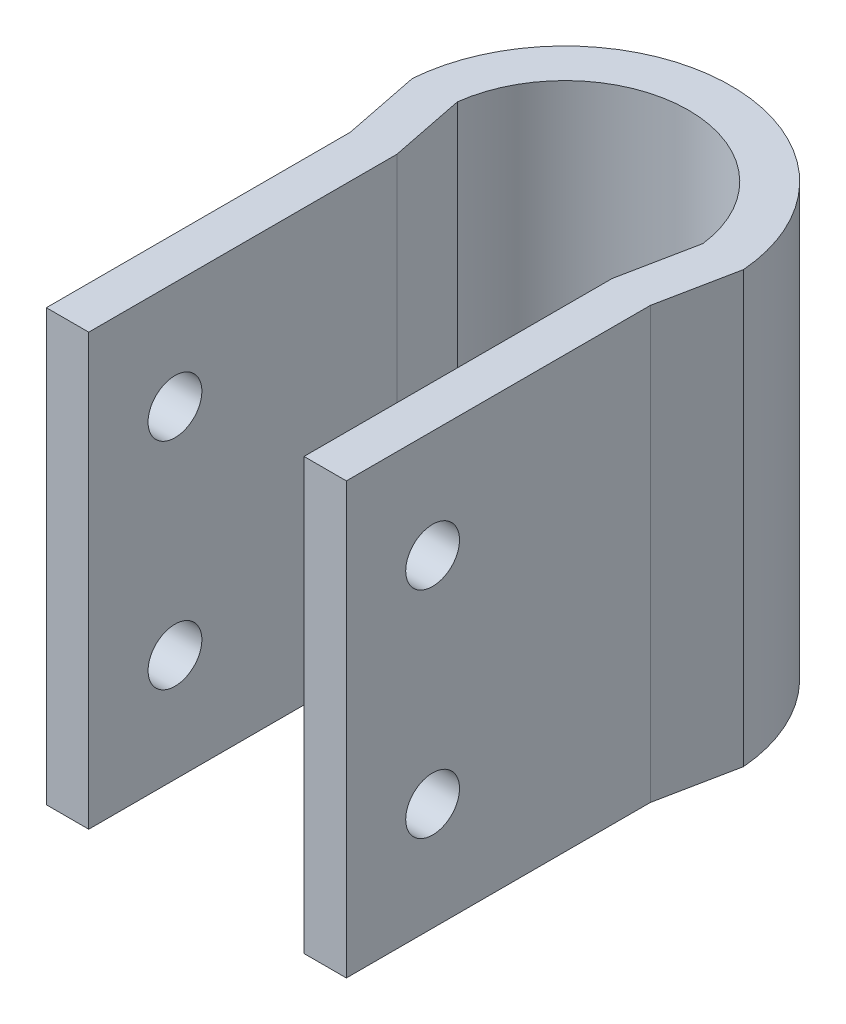
ISO-10303-21;
HEADER;
FILE_DESCRIPTION(('STEP AP214'),'2;1');
FILE_NAME('part.step','',(''),(''),'','','');
FILE_SCHEMA(('AUTOMOTIVE_DESIGN { 1 0 10303 214 1 1 1 1 }'));
ENDSEC;
DATA;
#1=APPLICATION_CONTEXT('core data for automotive mechanical design processes');
#2=APPLICATION_PROTOCOL_DEFINITION('international standard','automotive_design',2000,#1);
#3=PRODUCT_CONTEXT('',#1,'mechanical');
#4=PRODUCT('Part','Part','',(#3));
#5=PRODUCT_RELATED_PRODUCT_CATEGORY('part','',(#4));
#6=PRODUCT_DEFINITION_FORMATION('','',#4);
#7=PRODUCT_DEFINITION_CONTEXT('part definition',#1,'design');
#8=PRODUCT_DEFINITION('design','',#6,#7);
#9=PRODUCT_DEFINITION_SHAPE('','',#8);
#10=(LENGTH_UNIT() NAMED_UNIT(*) SI_UNIT(.MILLI.,.METRE.));
#11=(NAMED_UNIT(*) PLANE_ANGLE_UNIT() SI_UNIT($,.RADIAN.));
#12=(NAMED_UNIT(*) SI_UNIT($,.STERADIAN.) SOLID_ANGLE_UNIT());
#13=UNCERTAINTY_MEASURE_WITH_UNIT(LENGTH_MEASURE(1.E-05),#10,'distance_accuracy_value','');
#14=(GEOMETRIC_REPRESENTATION_CONTEXT(3) GLOBAL_UNCERTAINTY_ASSIGNED_CONTEXT((#13)) GLOBAL_UNIT_ASSIGNED_CONTEXT((#10,
#11,#12)) REPRESENTATION_CONTEXT('',''));
#15=CARTESIAN_POINT('',(0.,0.,0.));
#16=DIRECTION('',(0.,0.,1.));
#17=DIRECTION('',(1.,0.,0.));
#18=AXIS2_PLACEMENT_3D('',#15,#16,#17);
#19=CARTESIAN_POINT('',(-17.7,318.77,43.48));
#20=DIRECTION('',(0.,0.,1.));
#21=DIRECTION('',(1.,0.,0.));
#22=AXIS2_PLACEMENT_3D('',#19,#20,#21);
#23=PLANE('',#22);
#24=DIRECTION('',(1.,0.,0.));
#25=VECTOR('',#24,1.);
#26=CARTESIAN_POINT('',(-17.7,369.57,43.48));
#27=LINE('',#26,#25);
#28=CARTESIAN_POINT('',(-17.7,369.57,43.48));
#29=VERTEX_POINT('',#28);
#30=CARTESIAN_POINT('',(-12.7,369.57,43.48));
#31=VERTEX_POINT('',#30);
#32=EDGE_CURVE('E173',#29,#31,#27,.T.);
#33=ORIENTED_EDGE('',*,*,#32,.F.);
#34=DIRECTION('',(0.,1.,0.));
#35=VECTOR('',#34,1.);
#36=CARTESIAN_POINT('',(-17.7,318.77,43.48));
#37=LINE('',#36,#35);
#38=CARTESIAN_POINT('',(-17.7,318.77,43.48));
#39=VERTEX_POINT('',#38);
#40=EDGE_CURVE('E11',#39,#29,#37,.T.);
#41=ORIENTED_EDGE('',*,*,#40,.F.);
#42=DIRECTION('',(1.,0.,0.));
#43=VECTOR('',#42,1.);
#44=CARTESIAN_POINT('',(-17.7,318.77,43.48));
#45=LINE('',#44,#43);
#46=CARTESIAN_POINT('',(-12.7,318.77,43.48));
#47=VERTEX_POINT('',#46);
#48=EDGE_CURVE('E218',#39,#47,#45,.T.);
#49=ORIENTED_EDGE('',*,*,#48,.T.);
#50=DIRECTION('',(0.,1.,0.));
#51=VECTOR('',#50,1.);
#52=CARTESIAN_POINT('',(-12.7,318.77,43.48));
#53=LINE('',#52,#51);
#54=EDGE_CURVE('E114',#47,#31,#53,.T.);
#55=ORIENTED_EDGE('',*,*,#54,.T.);
#56=EDGE_LOOP('',(#33,#41,#49,#55));
#57=FACE_BOUND('',#56,.T.);
#58=ADVANCED_FACE('F45',(#57),#23,.T.);
#59=CARTESIAN_POINT('',(-17.7,318.77,43.48));
#60=DIRECTION('',(-1.,0.,0.));
#61=DIRECTION('',(0.,0.,1.));
#62=AXIS2_PLACEMENT_3D('',#59,#60,#61);
#63=PLANE('',#62);
#64=CARTESIAN_POINT('',(-17.7,356.87,33.305));
#65=DIRECTION('',(-1.,0.,0.));
#66=DIRECTION('',(0.,0.,1.));
#67=AXIS2_PLACEMENT_3D('',#64,#65,#66);
#68=CIRCLE('',#67,3.175);
#69=CARTESIAN_POINT('',(-17.7,356.87,36.48));
#70=VERTEX_POINT('',#69);
#71=EDGE_CURVE('E250',#70,#70,#68,.T.);
#72=ORIENTED_EDGE('',*,*,#71,.F.);
#73=EDGE_LOOP('',(#72));
#74=FACE_BOUND('',#73,.T.);
#75=CARTESIAN_POINT('',(-17.7,331.47,33.305));
#76=DIRECTION('',(-1.,0.,0.));
#77=DIRECTION('',(0.,0.,-1.));
#78=AXIS2_PLACEMENT_3D('',#75,#76,#77);
#79=CIRCLE('',#78,3.175);
#80=CARTESIAN_POINT('',(-17.7,331.47,30.13));
#81=VERTEX_POINT('',#80);
#82=EDGE_CURVE('E259',#81,#81,#79,.T.);
#83=ORIENTED_EDGE('',*,*,#82,.F.);
#84=EDGE_LOOP('',(#83));
#85=FACE_BOUND('',#84,.T.);
#86=DIRECTION('',(0.,0.,1.));
#87=VECTOR('',#86,1.);
#88=CARTESIAN_POINT('',(-17.7,369.57,43.48));
#89=LINE('',#88,#87);
#90=CARTESIAN_POINT('',(-17.7,369.57,7.61319175216006));
#91=VERTEX_POINT('',#90);
#92=EDGE_CURVE('E215',#91,#29,#89,.T.);
#93=ORIENTED_EDGE('',*,*,#92,.F.);
#94=DIRECTION('',(0.,1.,0.));
#95=VECTOR('',#94,1.);
#96=CARTESIAN_POINT('',(-17.7,318.77,7.61319175216006));
#97=LINE('',#96,#95);
#98=CARTESIAN_POINT('',(-17.7,318.77,7.61319175216006));
#99=VERTEX_POINT('',#98);
#100=EDGE_CURVE('E55',#99,#91,#97,.T.);
#101=ORIENTED_EDGE('',*,*,#100,.F.);
#102=DIRECTION('',(0.,0.,1.));
#103=VECTOR('',#102,1.);
#104=CARTESIAN_POINT('',(-17.7,318.77,43.48));
#105=LINE('',#104,#103);
#106=EDGE_CURVE('E159',#99,#39,#105,.T.);
#107=ORIENTED_EDGE('',*,*,#106,.T.);
#108=ORIENTED_EDGE('',*,*,#40,.T.);
#109=EDGE_LOOP('',(#93,#101,#107,#108));
#110=FACE_BOUND('',#109,.T.);
#111=ADVANCED_FACE('F331',(#74,#85,#110),#63,.T.);
#112=CARTESIAN_POINT('',(-17.7,318.77,7.61319175216006));
#113=DIRECTION('',(-0.980545317992595,0.,0.1962928408343));
#114=DIRECTION('',(0.1962928408343,0.,0.980545317992595));
#115=AXIS2_PLACEMENT_3D('',#112,#113,#114);
#116=PLANE('',#115);
#117=DIRECTION('',(0.1962928408343,0.,0.980545317992595));
#118=VECTOR('',#117,1.);
#119=CARTESIAN_POINT('',(-17.7,369.57,7.61319175216006));
#120=LINE('',#119,#118);
#121=CARTESIAN_POINT('',(-19.5338143213269,369.57,-1.54729540163647));
#122=VERTEX_POINT('',#121);
#123=EDGE_CURVE('E145',#122,#91,#120,.T.);
#124=ORIENTED_EDGE('',*,*,#123,.F.);
#125=DIRECTION('',(0.,1.,0.));
#126=VECTOR('',#125,1.);
#127=CARTESIAN_POINT('',(-19.5338143213269,318.77,-1.54729540163647));
#128=LINE('',#127,#126);
#129=CARTESIAN_POINT('',(-19.5338143213269,318.77,-1.54729540163647));
#130=VERTEX_POINT('',#129);
#131=EDGE_CURVE('E140',#130,#122,#128,.T.);
#132=ORIENTED_EDGE('',*,*,#131,.F.);
#133=DIRECTION('',(0.1962928408343,0.,0.980545317992595));
#134=VECTOR('',#133,1.);
#135=CARTESIAN_POINT('',(-17.7,318.77,7.61319175216006));
#136=LINE('',#135,#134);
#137=EDGE_CURVE('E143',#130,#99,#136,.T.);
#138=ORIENTED_EDGE('',*,*,#137,.T.);
#139=ORIENTED_EDGE('',*,*,#100,.T.);
#140=EDGE_LOOP('',(#124,#132,#138,#139));
#141=FACE_BOUND('',#140,.T.);
#142=ADVANCED_FACE('F142',(#141),#116,.T.);
#143=CARTESIAN_POINT('',(0.,318.77,0.));
#144=DIRECTION('',(0.,1.,0.));
#145=DIRECTION('',(0.,0.,1.));
#146=AXIS2_PLACEMENT_3D('',#143,#144,#145);
#147=CYLINDRICAL_SURFACE('',#146,19.595);
#148=CARTESIAN_POINT('',(0.,369.57,0.));
#149=DIRECTION('',(0.,1.,0.));
#150=DIRECTION('',(0.,0.,-1.));
#151=AXIS2_PLACEMENT_3D('',#148,#149,#150);
#152=CIRCLE('',#151,19.595);
#153=CARTESIAN_POINT('',(19.5338143213269,369.57,-1.54729540163646));
#154=VERTEX_POINT('',#153);
#155=EDGE_CURVE('E210',#154,#122,#152,.T.);
#156=ORIENTED_EDGE('',*,*,#155,.F.);
#157=DIRECTION('',(0.,1.,0.));
#158=VECTOR('',#157,1.);
#159=CARTESIAN_POINT('',(19.5338143213269,318.77,-1.54729540163646));
#160=LINE('',#159,#158);
#161=CARTESIAN_POINT('',(19.5338143213269,318.77,-1.54729540163646));
#162=VERTEX_POINT('',#161);
#163=EDGE_CURVE('E151',#162,#154,#160,.T.);
#164=ORIENTED_EDGE('',*,*,#163,.F.);
#165=CARTESIAN_POINT('',(0.,318.77,0.));
#166=DIRECTION('',(0.,1.,0.));
#167=DIRECTION('',(0.,0.,-1.));
#168=AXIS2_PLACEMENT_3D('',#165,#166,#167);
#169=CIRCLE('',#168,19.595);
#170=EDGE_CURVE('E157',#162,#130,#169,.T.);
#171=ORIENTED_EDGE('',*,*,#170,.T.);
#172=ORIENTED_EDGE('',*,*,#131,.T.);
#173=EDGE_LOOP('',(#156,#164,#171,#172));
#174=FACE_BOUND('',#173,.T.);
#175=ADVANCED_FACE('F162',(#174),#147,.T.);
#176=CARTESIAN_POINT('',(19.5338143213269,318.77,-1.54729540163646));
#177=DIRECTION('',(0.980545317992595,0.,0.1962928408343));
#178=DIRECTION('',(0.1962928408343,0.,-0.980545317992595));
#179=AXIS2_PLACEMENT_3D('',#176,#177,#178);
#180=PLANE('',#179);
#181=DIRECTION('',(0.1962928408343,0.,-0.980545317992596));
#182=VECTOR('',#181,1.);
#183=CARTESIAN_POINT('',(19.5338143213269,369.57,-1.54729540163646));
#184=LINE('',#183,#182);
#185=CARTESIAN_POINT('',(17.7,369.57,7.61319175216007));
#186=VERTEX_POINT('',#185);
#187=EDGE_CURVE('E206',#186,#154,#184,.T.);
#188=ORIENTED_EDGE('',*,*,#187,.F.);
#189=DIRECTION('',(0.,1.,0.));
#190=VECTOR('',#189,1.);
#191=CARTESIAN_POINT('',(17.7,318.77,7.61319175216007));
#192=LINE('',#191,#190);
#193=CARTESIAN_POINT('',(17.7,318.77,7.61319175216007));
#194=VERTEX_POINT('',#193);
#195=EDGE_CURVE('E224',#194,#186,#192,.T.);
#196=ORIENTED_EDGE('',*,*,#195,.F.);
#197=DIRECTION('',(0.1962928408343,0.,-0.980545317992596));
#198=VECTOR('',#197,1.);
#199=CARTESIAN_POINT('',(19.5338143213269,318.77,-1.54729540163646));
#200=LINE('',#199,#198);
#201=EDGE_CURVE('E164',#194,#162,#200,.T.);
#202=ORIENTED_EDGE('',*,*,#201,.T.);
#203=ORIENTED_EDGE('',*,*,#163,.T.);
#204=EDGE_LOOP('',(#188,#196,#202,#203));
#205=FACE_BOUND('',#204,.T.);
#206=ADVANCED_FACE('F347',(#205),#180,.T.);
#207=CARTESIAN_POINT('',(17.7,318.77,7.61319175216007));
#208=DIRECTION('',(1.,0.,0.));
#209=DIRECTION('',(0.,0.,-1.));
#210=AXIS2_PLACEMENT_3D('',#207,#208,#209);
#211=PLANE('',#210);
#212=CARTESIAN_POINT('',(17.7,356.87,33.305));
#213=DIRECTION('',(1.,0.,0.));
#214=DIRECTION('',(0.,0.,-1.));
#215=AXIS2_PLACEMENT_3D('',#212,#213,#214);
#216=CIRCLE('',#215,3.175);
#217=CARTESIAN_POINT('',(17.7,356.87,30.13));
#218=VERTEX_POINT('',#217);
#219=EDGE_CURVE('E178',#218,#218,#216,.T.);
#220=ORIENTED_EDGE('',*,*,#219,.F.);
#221=EDGE_LOOP('',(#220));
#222=FACE_BOUND('',#221,.T.);
#223=CARTESIAN_POINT('',(17.7,331.47,33.305));
#224=DIRECTION('',(1.,0.,0.));
#225=DIRECTION('',(0.,0.,-1.));
#226=AXIS2_PLACEMENT_3D('',#223,#224,#225);
#227=CIRCLE('',#226,3.175);
#228=CARTESIAN_POINT('',(17.7,331.47,30.13));
#229=VERTEX_POINT('',#228);
#230=EDGE_CURVE('E256',#229,#229,#227,.T.);
#231=ORIENTED_EDGE('',*,*,#230,.F.);
#232=EDGE_LOOP('',(#231));
#233=FACE_BOUND('',#232,.T.);
#234=DIRECTION('',(0.,0.,-1.));
#235=VECTOR('',#234,1.);
#236=CARTESIAN_POINT('',(17.7,369.57,7.61319175216007));
#237=LINE('',#236,#235);
#238=CARTESIAN_POINT('',(17.7,369.57,43.48));
#239=VERTEX_POINT('',#238);
#240=EDGE_CURVE('E202',#239,#186,#237,.T.);
#241=ORIENTED_EDGE('',*,*,#240,.F.);
#242=DIRECTION('',(0.,1.,0.));
#243=VECTOR('',#242,1.);
#244=CARTESIAN_POINT('',(17.7,318.77,43.48));
#245=LINE('',#244,#243);
#246=CARTESIAN_POINT('',(17.7,318.77,43.48));
#247=VERTEX_POINT('',#246);
#248=EDGE_CURVE('E227',#247,#239,#245,.T.);
#249=ORIENTED_EDGE('',*,*,#248,.F.);
#250=DIRECTION('',(0.,0.,-1.));
#251=VECTOR('',#250,1.);
#252=CARTESIAN_POINT('',(17.7,318.77,7.61319175216007));
#253=LINE('',#252,#251);
#254=EDGE_CURVE('E167',#247,#194,#253,.T.);
#255=ORIENTED_EDGE('',*,*,#254,.T.);
#256=ORIENTED_EDGE('',*,*,#195,.T.);
#257=EDGE_LOOP('',(#241,#249,#255,#256));
#258=FACE_BOUND('',#257,.T.);
#259=ADVANCED_FACE('F306',(#222,#233,#258),#211,.T.);
#260=CARTESIAN_POINT('',(12.7,318.77,43.48));
#261=DIRECTION('',(0.,0.,1.));
#262=DIRECTION('',(1.,0.,0.));
#263=AXIS2_PLACEMENT_3D('',#260,#261,#262);
#264=PLANE('',#263);
#265=DIRECTION('',(1.,0.,0.));
#266=VECTOR('',#265,1.);
#267=CARTESIAN_POINT('',(12.7,369.57,43.48));
#268=LINE('',#267,#266);
#269=CARTESIAN_POINT('',(12.7,369.57,43.48));
#270=VERTEX_POINT('',#269);
#271=EDGE_CURVE('E198',#270,#239,#268,.T.);
#272=ORIENTED_EDGE('',*,*,#271,.F.);
#273=DIRECTION('',(0.,1.,0.));
#274=VECTOR('',#273,1.);
#275=CARTESIAN_POINT('',(12.7,318.77,43.48));
#276=LINE('',#275,#274);
#277=CARTESIAN_POINT('',(12.7,318.77,43.48));
#278=VERTEX_POINT('',#277);
#279=EDGE_CURVE('E230',#278,#270,#276,.T.);
#280=ORIENTED_EDGE('',*,*,#279,.F.);
#281=DIRECTION('',(1.,0.,0.));
#282=VECTOR('',#281,1.);
#283=CARTESIAN_POINT('',(12.7,318.77,43.48));
#284=LINE('',#283,#282);
#285=EDGE_CURVE('E298',#278,#247,#284,.T.);
#286=ORIENTED_EDGE('',*,*,#285,.T.);
#287=ORIENTED_EDGE('',*,*,#248,.T.);
#288=EDGE_LOOP('',(#272,#280,#286,#287));
#289=FACE_BOUND('',#288,.T.);
#290=ADVANCED_FACE('F312',(#289),#264,.T.);
#291=CARTESIAN_POINT('',(12.7,318.77,7.11763924182101));
#292=DIRECTION('',(-1.,0.,0.));
#293=DIRECTION('',(0.,0.,1.));
#294=AXIS2_PLACEMENT_3D('',#291,#292,#293);
#295=PLANE('',#294);
#296=CARTESIAN_POINT('',(12.7,356.87,33.305));
#297=DIRECTION('',(-1.,0.,0.));
#298=DIRECTION('',(0.,0.,1.));
#299=AXIS2_PLACEMENT_3D('',#296,#297,#298);
#300=CIRCLE('',#299,3.175);
#301=CARTESIAN_POINT('',(12.7,356.87,36.48));
#302=VERTEX_POINT('',#301);
#303=EDGE_CURVE('E270',#302,#302,#300,.T.);
#304=ORIENTED_EDGE('',*,*,#303,.F.);
#305=EDGE_LOOP('',(#304));
#306=FACE_BOUND('',#305,.T.);
#307=CARTESIAN_POINT('',(12.7,331.47,33.305));
#308=DIRECTION('',(-1.,0.,0.));
#309=DIRECTION('',(0.,0.,1.));
#310=AXIS2_PLACEMENT_3D('',#307,#308,#309);
#311=CIRCLE('',#310,3.175);
#312=CARTESIAN_POINT('',(12.7,331.47,36.48));
#313=VERTEX_POINT('',#312);
#314=EDGE_CURVE('E249',#313,#313,#311,.T.);
#315=ORIENTED_EDGE('',*,*,#314,.F.);
#316=EDGE_LOOP('',(#315));
#317=FACE_BOUND('',#316,.T.);
#318=DIRECTION('',(0.,0.,1.));
#319=VECTOR('',#318,1.);
#320=CARTESIAN_POINT('',(12.7,369.57,7.11763924182101));
#321=LINE('',#320,#319);
#322=CARTESIAN_POINT('',(12.7,369.57,7.11763924182101));
#323=VERTEX_POINT('',#322);
#324=EDGE_CURVE('E194',#323,#270,#321,.T.);
#325=ORIENTED_EDGE('',*,*,#324,.F.);
#326=DIRECTION('',(0.,1.,0.));
#327=VECTOR('',#326,1.);
#328=CARTESIAN_POINT('',(12.7,318.77,7.11763924182101));
#329=LINE('',#328,#327);
#330=CARTESIAN_POINT('',(12.7,318.77,7.11763924182101));
#331=VERTEX_POINT('',#330);
#332=EDGE_CURVE('E233',#331,#323,#329,.T.);
#333=ORIENTED_EDGE('',*,*,#332,.F.);
#334=DIRECTION('',(0.,0.,1.));
#335=VECTOR('',#334,1.);
#336=CARTESIAN_POINT('',(12.7,318.77,7.11763924182101));
#337=LINE('',#336,#335);
#338=EDGE_CURVE('E294',#331,#278,#337,.T.);
#339=ORIENTED_EDGE('',*,*,#338,.T.);
#340=ORIENTED_EDGE('',*,*,#279,.T.);
#341=EDGE_LOOP('',(#325,#333,#339,#340));
#342=FACE_BOUND('',#341,.T.);
#343=ADVANCED_FACE('F315',(#306,#317,#342),#295,.T.);
#344=CARTESIAN_POINT('',(14.4841982864085,318.77,-1.795));
#345=DIRECTION('',(-0.980545317992595,0.,-0.1962928408343));
#346=DIRECTION('',(-0.1962928408343,0.,0.980545317992596));
#347=AXIS2_PLACEMENT_3D('',#344,#345,#346);
#348=PLANE('',#347);
#349=DIRECTION('',(-0.1962928408343,0.,0.980545317992595));
#350=VECTOR('',#349,1.);
#351=CARTESIAN_POINT('',(14.4841982864085,369.57,-1.795));
#352=LINE('',#351,#350);
#353=CARTESIAN_POINT('',(14.4841982864085,369.57,-1.795));
#354=VERTEX_POINT('',#353);
#355=EDGE_CURVE('E190',#354,#323,#352,.T.);
#356=ORIENTED_EDGE('',*,*,#355,.F.);
#357=DIRECTION('',(0.,1.,0.));
#358=VECTOR('',#357,1.);
#359=CARTESIAN_POINT('',(14.4841982864085,318.77,-1.795));
#360=LINE('',#359,#358);
#361=CARTESIAN_POINT('',(14.4841982864085,318.77,-1.795));
#362=VERTEX_POINT('',#361);
#363=EDGE_CURVE('E236',#362,#354,#360,.T.);
#364=ORIENTED_EDGE('',*,*,#363,.F.);
#365=DIRECTION('',(-0.1962928408343,0.,0.980545317992595));
#366=VECTOR('',#365,1.);
#367=CARTESIAN_POINT('',(14.4841982864085,318.77,-1.795));
#368=LINE('',#367,#366);
#369=EDGE_CURVE('E290',#362,#331,#368,.T.);
#370=ORIENTED_EDGE('',*,*,#369,.T.);
#371=ORIENTED_EDGE('',*,*,#332,.T.);
#372=EDGE_LOOP('',(#356,#364,#370,#371));
#373=FACE_BOUND('',#372,.T.);
#374=ADVANCED_FACE('F320',(#373),#348,.T.);
#375=CARTESIAN_POINT('',(0.,318.77,0.));
#376=DIRECTION('',(0.,1.,0.));
#377=DIRECTION('',(0.,0.,1.));
#378=AXIS2_PLACEMENT_3D('',#375,#376,#377);
#379=CYLINDRICAL_SURFACE('',#378,14.595);
#380=CARTESIAN_POINT('',(0.,369.57,0.));
#381=DIRECTION('',(0.,-1.,0.));
#382=DIRECTION('',(0.,0.,-1.));
#383=AXIS2_PLACEMENT_3D('',#380,#381,#382);
#384=CIRCLE('',#383,14.595);
#385=CARTESIAN_POINT('',(-14.4841982864085,369.57,-1.795));
#386=VERTEX_POINT('',#385);
#387=EDGE_CURVE('E186',#386,#354,#384,.T.);
#388=ORIENTED_EDGE('',*,*,#387,.F.);
#389=DIRECTION('',(0.,1.,0.));
#390=VECTOR('',#389,1.);
#391=CARTESIAN_POINT('',(-14.4841982864085,318.77,-1.795));
#392=LINE('',#391,#390);
#393=CARTESIAN_POINT('',(-14.4841982864085,318.77,-1.795));
#394=VERTEX_POINT('',#393);
#395=EDGE_CURVE('E239',#394,#386,#392,.T.);
#396=ORIENTED_EDGE('',*,*,#395,.F.);
#397=CARTESIAN_POINT('',(0.,318.77,0.));
#398=DIRECTION('',(0.,-1.,0.));
#399=DIRECTION('',(0.,0.,-1.));
#400=AXIS2_PLACEMENT_3D('',#397,#398,#399);
#401=CIRCLE('',#400,14.595);
#402=EDGE_CURVE('E286',#394,#362,#401,.T.);
#403=ORIENTED_EDGE('',*,*,#402,.T.);
#404=ORIENTED_EDGE('',*,*,#363,.T.);
#405=EDGE_LOOP('',(#388,#396,#403,#404));
#406=FACE_BOUND('',#405,.T.);
#407=ADVANCED_FACE('F323',(#406),#379,.F.);
#408=CARTESIAN_POINT('',(-12.7,318.77,7.11763924182101));
#409=DIRECTION('',(0.980545317992595,0.,-0.1962928408343));
#410=DIRECTION('',(-0.1962928408343,0.,-0.980545317992596));
#411=AXIS2_PLACEMENT_3D('',#408,#409,#410);
#412=PLANE('',#411);
#413=DIRECTION('',(-0.1962928408343,0.,-0.980545317992595));
#414=VECTOR('',#413,1.);
#415=CARTESIAN_POINT('',(-12.7,369.57,7.11763924182101));
#416=LINE('',#415,#414);
#417=CARTESIAN_POINT('',(-12.7,369.57,7.11763924182101));
#418=VERTEX_POINT('',#417);
#419=EDGE_CURVE('E182',#418,#386,#416,.T.);
#420=ORIENTED_EDGE('',*,*,#419,.F.);
#421=DIRECTION('',(0.,1.,0.));
#422=VECTOR('',#421,1.);
#423=CARTESIAN_POINT('',(-12.7,318.77,7.11763924182101));
#424=LINE('',#423,#422);
#425=CARTESIAN_POINT('',(-12.7,318.77,7.11763924182101));
#426=VERTEX_POINT('',#425);
#427=EDGE_CURVE('E242',#426,#418,#424,.T.);
#428=ORIENTED_EDGE('',*,*,#427,.F.);
#429=DIRECTION('',(-0.1962928408343,0.,-0.980545317992595));
#430=VECTOR('',#429,1.);
#431=CARTESIAN_POINT('',(-12.7,318.77,7.11763924182101));
#432=LINE('',#431,#430);
#433=EDGE_CURVE('E282',#426,#394,#432,.T.);
#434=ORIENTED_EDGE('',*,*,#433,.T.);
#435=ORIENTED_EDGE('',*,*,#395,.T.);
#436=EDGE_LOOP('',(#420,#428,#434,#435));
#437=FACE_BOUND('',#436,.T.);
#438=ADVANCED_FACE('F327',(#437),#412,.T.);
#439=CARTESIAN_POINT('',(-12.7,318.77,43.48));
#440=DIRECTION('',(1.,0.,0.));
#441=DIRECTION('',(0.,0.,-1.));
#442=AXIS2_PLACEMENT_3D('',#439,#440,#441);
#443=PLANE('',#442);
#444=CARTESIAN_POINT('',(-12.7,356.87,33.305));
#445=DIRECTION('',(1.,0.,0.));
#446=DIRECTION('',(0.,0.,-1.));
#447=AXIS2_PLACEMENT_3D('',#444,#445,#446);
#448=CIRCLE('',#447,3.175);
#449=CARTESIAN_POINT('',(-12.7,356.87,30.13));
#450=VERTEX_POINT('',#449);
#451=EDGE_CURVE('E48',#450,#450,#448,.T.);
#452=ORIENTED_EDGE('',*,*,#451,.F.);
#453=EDGE_LOOP('',(#452));
#454=FACE_BOUND('',#453,.T.);
#455=CARTESIAN_POINT('',(-12.7,331.47,33.305));
#456=DIRECTION('',(1.,0.,0.));
#457=DIRECTION('',(0.,0.,-1.));
#458=AXIS2_PLACEMENT_3D('',#455,#456,#457);
#459=CIRCLE('',#458,3.175);
#460=CARTESIAN_POINT('',(-12.7,331.47,30.13));
#461=VERTEX_POINT('',#460);
#462=EDGE_CURVE('E246',#461,#461,#459,.T.);
#463=ORIENTED_EDGE('',*,*,#462,.F.);
#464=EDGE_LOOP('',(#463));
#465=FACE_BOUND('',#464,.T.);
#466=DIRECTION('',(0.,0.,-1.));
#467=VECTOR('',#466,1.);
#468=CARTESIAN_POINT('',(-12.7,369.57,43.48));
#469=LINE('',#468,#467);
#470=EDGE_CURVE('E177',#31,#418,#469,.T.);
#471=ORIENTED_EDGE('',*,*,#470,.F.);
#472=ORIENTED_EDGE('',*,*,#54,.F.);
#473=DIRECTION('',(0.,0.,-1.));
#474=VECTOR('',#473,1.);
#475=CARTESIAN_POINT('',(-12.7,318.77,43.48));
#476=LINE('',#475,#474);
#477=EDGE_CURVE('E279',#47,#426,#476,.T.);
#478=ORIENTED_EDGE('',*,*,#477,.T.);
#479=ORIENTED_EDGE('',*,*,#427,.T.);
#480=EDGE_LOOP('',(#471,#472,#478,#479));
#481=FACE_BOUND('',#480,.T.);
#482=ADVANCED_FACE('F328',(#454,#465,#481),#443,.T.);
#483=CARTESIAN_POINT('',(0.,318.77,0.));
#484=DIRECTION('',(0.,-1.,0.));
#485=DIRECTION('',(0.,0.,-1.));
#486=AXIS2_PLACEMENT_3D('',#483,#484,#485);
#487=PLANE('',#486);
#488=ORIENTED_EDGE('',*,*,#48,.F.);
#489=ORIENTED_EDGE('',*,*,#106,.F.);
#490=ORIENTED_EDGE('',*,*,#137,.F.);
#491=ORIENTED_EDGE('',*,*,#170,.F.);
#492=ORIENTED_EDGE('',*,*,#201,.F.);
#493=ORIENTED_EDGE('',*,*,#254,.F.);
#494=ORIENTED_EDGE('',*,*,#285,.F.);
#495=ORIENTED_EDGE('',*,*,#338,.F.);
#496=ORIENTED_EDGE('',*,*,#369,.F.);
#497=ORIENTED_EDGE('',*,*,#402,.F.);
#498=ORIENTED_EDGE('',*,*,#433,.F.);
#499=ORIENTED_EDGE('',*,*,#477,.F.);
#500=EDGE_LOOP('',(#488,#489,#490,#491,#492,#493,#494,#495,#496,#497,#498,#499));
#501=FACE_BOUND('',#500,.T.);
#502=ADVANCED_FACE('F155',(#501),#487,.T.);
#503=CARTESIAN_POINT('',(0.,369.57,0.));
#504=DIRECTION('',(0.,-1.,0.));
#505=DIRECTION('',(0.,0.,-1.));
#506=AXIS2_PLACEMENT_3D('',#503,#504,#505);
#507=PLANE('',#506);
#508=ORIENTED_EDGE('',*,*,#32,.T.);
#509=ORIENTED_EDGE('',*,*,#470,.T.);
#510=ORIENTED_EDGE('',*,*,#419,.T.);
#511=ORIENTED_EDGE('',*,*,#387,.T.);
#512=ORIENTED_EDGE('',*,*,#355,.T.);
#513=ORIENTED_EDGE('',*,*,#324,.T.);
#514=ORIENTED_EDGE('',*,*,#271,.T.);
#515=ORIENTED_EDGE('',*,*,#240,.T.);
#516=ORIENTED_EDGE('',*,*,#187,.T.);
#517=ORIENTED_EDGE('',*,*,#155,.T.);
#518=ORIENTED_EDGE('',*,*,#123,.T.);
#519=ORIENTED_EDGE('',*,*,#92,.T.);
#520=EDGE_LOOP('',(#508,#509,#510,#511,#512,#513,#514,#515,#516,#517,#518,#519));
#521=FACE_BOUND('',#520,.T.);
#522=ADVANCED_FACE('F330',(#521),#507,.F.);
#523=CARTESIAN_POINT('',(19.5338143213269,331.47,33.305));
#524=DIRECTION('',(-1.,0.,0.));
#525=DIRECTION('',(0.,0.,1.));
#526=AXIS2_PLACEMENT_3D('',#523,#524,#525);
#527=CYLINDRICAL_SURFACE('',#526,3.175);
#528=ORIENTED_EDGE('',*,*,#462,.T.);
#529=EDGE_LOOP('',(#528));
#530=FACE_BOUND('',#529,.T.);
#531=ORIENTED_EDGE('',*,*,#82,.T.);
#532=EDGE_LOOP('',(#531));
#533=FACE_BOUND('',#532,.T.);
#534=ADVANCED_FACE('F378',(#530,#533),#527,.F.);
#535=CARTESIAN_POINT('',(19.5338143213269,356.87,33.305));
#536=DIRECTION('',(-1.,0.,0.));
#537=DIRECTION('',(0.,0.,1.));
#538=AXIS2_PLACEMENT_3D('',#535,#536,#537);
#539=CYLINDRICAL_SURFACE('',#538,3.175);
#540=ORIENTED_EDGE('',*,*,#451,.T.);
#541=EDGE_LOOP('',(#540));
#542=FACE_BOUND('',#541,.T.);
#543=ORIENTED_EDGE('',*,*,#71,.T.);
#544=EDGE_LOOP('',(#543));
#545=FACE_BOUND('',#544,.T.);
#546=ADVANCED_FACE('F375',(#542,#545),#539,.F.);
#547=ORIENTED_EDGE('',*,*,#230,.T.);
#548=EDGE_LOOP('',(#547));
#549=FACE_BOUND('',#548,.T.);
#550=ORIENTED_EDGE('',*,*,#314,.T.);
#551=EDGE_LOOP('',(#550));
#552=FACE_BOUND('',#551,.T.);
#553=ADVANCED_FACE('F377',(#549,#552),#527,.F.);
#554=ORIENTED_EDGE('',*,*,#219,.T.);
#555=EDGE_LOOP('',(#554));
#556=FACE_BOUND('',#555,.T.);
#557=ORIENTED_EDGE('',*,*,#303,.T.);
#558=EDGE_LOOP('',(#557));
#559=FACE_BOUND('',#558,.T.);
#560=ADVANCED_FACE('F380',(#556,#559),#539,.F.);
#561=CLOSED_SHELL('',(#58,#111,#142,#175,#206,#259,#290,#343,#374,#407,#438,#482,#502,#522,#534,
#546,#553,#560));
#562=MANIFOLD_SOLID_BREP('B2',#561);
#563=ADVANCED_BREP_SHAPE_REPRESENTATION('',(#18,#562),#14);
#564=SHAPE_DEFINITION_REPRESENTATION(#9,#563);
ENDSEC;
END-ISO-10303-21;
